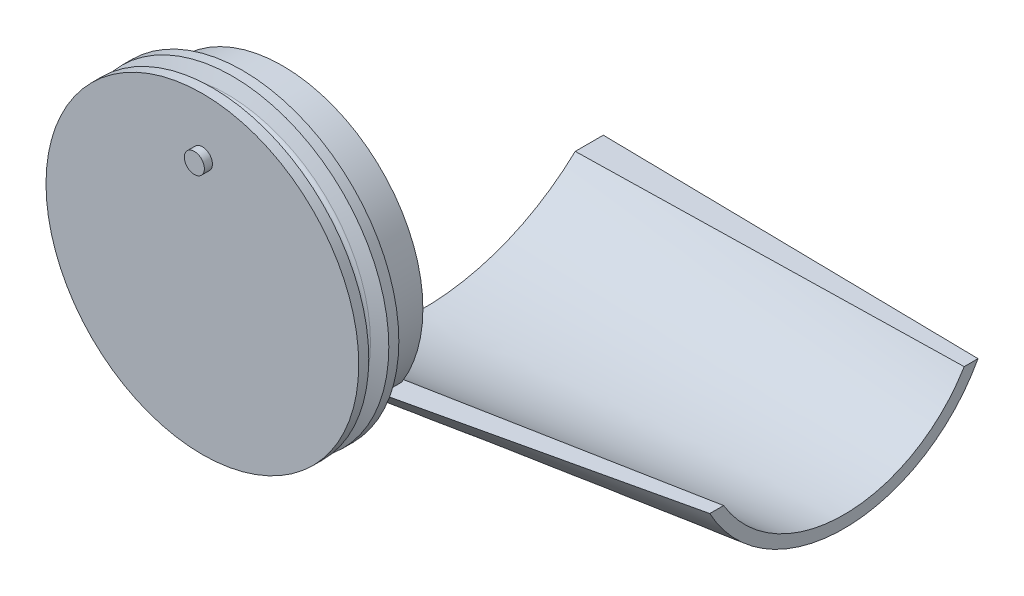
ISO-10303-21;
HEADER;
FILE_DESCRIPTION(('STEP AP214'),'2;1');
FILE_NAME('part.step','',(''),(''),'','','');
FILE_SCHEMA(('AUTOMOTIVE_DESIGN { 1 0 10303 214 1 1 1 1 }'));
ENDSEC;
DATA;
#1=APPLICATION_CONTEXT('core data for automotive mechanical design processes');
#2=APPLICATION_PROTOCOL_DEFINITION('international standard','automotive_design',2000,#1);
#3=PRODUCT_CONTEXT('',#1,'mechanical');
#4=PRODUCT('Part','Part','',(#3));
#5=PRODUCT_RELATED_PRODUCT_CATEGORY('part','',(#4));
#6=PRODUCT_DEFINITION_FORMATION('','',#4);
#7=PRODUCT_DEFINITION_CONTEXT('part definition',#1,'design');
#8=PRODUCT_DEFINITION('design','',#6,#7);
#9=PRODUCT_DEFINITION_SHAPE('','',#8);
#10=(LENGTH_UNIT() NAMED_UNIT(*) SI_UNIT(.MILLI.,.METRE.));
#11=(NAMED_UNIT(*) PLANE_ANGLE_UNIT() SI_UNIT($,.RADIAN.));
#12=(NAMED_UNIT(*) SI_UNIT($,.STERADIAN.) SOLID_ANGLE_UNIT());
#13=UNCERTAINTY_MEASURE_WITH_UNIT(LENGTH_MEASURE(1.E-05),#10,'distance_accuracy_value','');
#14=(GEOMETRIC_REPRESENTATION_CONTEXT(3) GLOBAL_UNCERTAINTY_ASSIGNED_CONTEXT((#13)) GLOBAL_UNIT_ASSIGNED_CONTEXT((#10,
#11,#12)) REPRESENTATION_CONTEXT('',''));
#15=CARTESIAN_POINT('',(0.,0.,0.));
#16=DIRECTION('',(0.,0.,1.));
#17=DIRECTION('',(1.,0.,0.));
#18=AXIS2_PLACEMENT_3D('',#15,#16,#17);
#19=CARTESIAN_POINT('',(0.,0.,0.));
#20=DIRECTION('',(0.,0.,1.));
#21=DIRECTION('',(1.,0.,0.));
#22=AXIS2_PLACEMENT_3D('',#19,#20,#21);
#23=PLANE('',#22);
#24=CARTESIAN_POINT('',(0.,0.,0.));
#25=DIRECTION('',(0.,0.,1.));
#26=DIRECTION('',(1.,0.,0.));
#27=AXIS2_PLACEMENT_3D('',#24,#25,#26);
#28=CIRCLE('',#27,15.);
#29=CARTESIAN_POINT('',(15.,0.,0.));
#30=VERTEX_POINT('',#29);
#31=EDGE_CURVE('E353',#30,#30,#28,.T.);
#32=ORIENTED_EDGE('',*,*,#31,.T.);
#33=EDGE_LOOP('',(#32));
#34=FACE_BOUND('',#33,.T.);
#35=DIRECTION('',(0.998752338877845,0.0499376169438923,0.));
#36=VECTOR('',#35,1.);
#37=CARTESIAN_POINT('',(0.997506234413968,-19.9501246882793,0.));
#38=LINE('',#37,#36);
#39=CARTESIAN_POINT('',(23.0574529661965,-18.8471273516902,0.));
#40=VERTEX_POINT('',#39);
#41=CARTESIAN_POINT('',(29.7018205805051,-18.5149089709748,0.));
#42=VERTEX_POINT('',#41);
#43=EDGE_CURVE('E234',#40,#42,#38,.T.);
#44=ORIENTED_EDGE('',*,*,#43,.F.);
#45=CARTESIAN_POINT('',(23.0574529661965,-18.8471273516902,0.));
#46=CARTESIAN_POINT('',(22.2916022190324,-18.9889397255002,0.));
#47=CARTESIAN_POINT('',(21.5253890123733,-19.128788030371,0.));
#48=CARTESIAN_POINT('',(19.9923482768048,-19.4047632030319,0.));
#49=CARTESIAN_POINT('',(19.2255207950077,-19.5408903324597,0.));
#50=CARTESIAN_POINT('',(17.6912902957024,-19.8096434498456,0.));
#51=CARTESIAN_POINT('',(16.9238873070428,-19.9422696026188,0.));
#52=CARTESIAN_POINT('',(15.3885392283414,-20.2042155018485,0.));
#53=CARTESIAN_POINT('',(14.6205941538221,-20.3335353393244,0.));
#54=CARTESIAN_POINT('',(13.0841928700881,-20.5890475414554,0.));
#55=CARTESIAN_POINT('',(12.315736666621,-20.7152399406868,0.));
#56=CARTESIAN_POINT('',(10.7783534139274,-20.9646585186056,0.));
#57=CARTESIAN_POINT('',(10.0094263709039,-21.0878847355429,0.));
#58=CARTESIAN_POINT('',(8.471111790358,-21.3315233812561,0.));
#59=CARTESIAN_POINT('',(7.70172424433659,-21.4519357563478,0.));
#60=CARTESIAN_POINT('',(6.16250972977857,-21.6900847019524,0.));
#61=CARTESIAN_POINT('',(5.39268274779645,-21.8078211855334,0.));
#62=CARTESIAN_POINT('',(3.85260895768149,-22.0407461475787,0.));
#63=CARTESIAN_POINT('',(3.08236213257115,-22.1559345137353,0.));
#64=CARTESIAN_POINT('',(1.54146614550797,-22.3838790995545,0.));
#65=CARTESIAN_POINT('',(0.770816964085725,-22.4966351876278,0.));
#66=CARTESIAN_POINT('',(0.,-22.6082295326803,0.));
#67=B_SPLINE_CURVE_WITH_KNOTS('',3,(#45,#46,#47,#48,#49,#50,#51,#52,#53,#54,#55,#56,#57,#58,#59,
#60,#61,#62,#63,#64,#65,#66),.UNSPECIFIED.,.F.,.F.,(4,2,2,2,2,2,2,2,2,2,4),(0.,2.33660498122198,
4.67304524981457,7.0093753291906,9.34564102239082,11.6818808746488,14.0180905841324,
16.3543448289866,18.6906748637148,21.0271076673683,23.3636665596837),.UNSPECIFIED.);
#68=CARTESIAN_POINT('',(0.,-22.608699195932,2.94938227622188E-08));
#69=VERTEX_POINT('',#68);
#70=EDGE_CURVE('E12',#40,#69,#67,.T.);
#71=ORIENTED_EDGE('',*,*,#70,.T.);
#72=DIRECTION('',(0.,1.,0.));
#73=VECTOR('',#72,1.);
#74=CARTESIAN_POINT('',(0.,0.,0.));
#75=LINE('',#74,#73);
#76=CARTESIAN_POINT('',(0.,-28.8762786833392,2.65474298902398E-09));
#77=VERTEX_POINT('',#76);
#78=EDGE_CURVE('E79',#77,#69,#75,.T.);
#79=ORIENTED_EDGE('',*,*,#78,.F.);
#80=CARTESIAN_POINT('',(0.,-28.8762293508559,-4.86217432960588E-09));
#81=CARTESIAN_POINT('',(0.987714442048364,-28.7331730352976,-1.74602065120115E-09));
#82=CARTESIAN_POINT('',(1.97521353454427,-28.5886256861832,-4.67826676747853E-10));
#83=CARTESIAN_POINT('',(3.94966770078597,-28.2963900436687,4.67790025991617E-10));
#84=CARTESIAN_POINT('',(4.93662281109079,-28.1487019972256,1.25339721859396E-10));
#85=CARTESIAN_POINT('',(6.90996284563093,-27.8500139563771,-1.25331132282855E-10));
#86=CARTESIAN_POINT('',(7.89634780430617,-27.6990141896344,-3.35814386069401E-11));
#87=CARTESIAN_POINT('',(9.86851758540095,-27.3935100024434,3.35795278206633E-11));
#88=CARTESIAN_POINT('',(10.8543024387747,-27.2390057818992,8.99741993983633E-12));
#89=CARTESIAN_POINT('',(12.8252414647675,-26.9262953480926,-8.99703171313495E-12));
#90=CARTESIAN_POINT('',(13.8103956627641,-26.768089294854,-2.41072037336909E-12));
#91=CARTESIAN_POINT('',(15.7800389522988,-26.4477528747474,2.41065554065078E-12));
#92=CARTESIAN_POINT('',(16.7645280610114,-26.2856226135324,6.45944704430521E-13));
#93=CARTESIAN_POINT('',(18.7328440677965,-25.9571863611272,-6.45966533334797E-13));
#94=CARTESIAN_POINT('',(19.7166709423662,-25.7908802290085,-1.7309131896018E-13));
#95=CARTESIAN_POINT('',(21.6835748466414,-25.4538294968453,1.73093081070269E-13));
#96=CARTESIAN_POINT('',(22.6666518686114,-25.2830848516335,0.));
#97=CARTESIAN_POINT('',(24.632002128606,-24.936859540798,0.));
#98=CARTESIAN_POINT('',(25.6142753419782,-24.7613787351424,0.));
#99=CARTESIAN_POINT('',(27.5779576561674,-24.4053491228362,0.));
#100=CARTESIAN_POINT('',(28.5593667079592,-24.2248000456346,0.));
#101=CARTESIAN_POINT('',(30.5212546323829,-23.8582666460942,0.));
#102=CARTESIAN_POINT('',(31.501733421159,-23.6722818744178,0.));
#103=CARTESIAN_POINT('',(33.4616817082158,-23.2944505211443,0.));
#104=CARTESIAN_POINT('',(34.4411510722366,-23.1026032433632,0.));
#105=CARTESIAN_POINT('',(35.42,-22.9076263811486,0.));
#106=B_SPLINE_CURVE_WITH_KNOTS('',3,(#80,#81,#82,#83,#84,#85,#86,#87,#88,#89,#90,#91,#92,#93,
#94,#95,#96,#97,#98,#99,#100,#101,#102,#103,#104,#105),.UNSPECIFIED.,.F.,.F.,(4,2,2,2,2,2,2,2,2,
2,2,2,4),(0.,2.9940612614052,5.98788796027924,8.98150949112513,11.9749606846902,
14.9682827148183,17.9615242440281,20.9548669261421,23.9482400811843,26.9417018370541,
29.9353236928895,32.9291937180938,35.9234206634662),.UNSPECIFIED.);
#107=CARTESIAN_POINT('',(24.5441383635427,-24.9516587022038,-1.08637057683048E-13));
#108=VERTEX_POINT('',#107);
#109=EDGE_CURVE('E230',#77,#108,#106,.T.);
#110=ORIENTED_EDGE('',*,*,#109,.T.);
#111=CARTESIAN_POINT('',(0.,0.,0.));
#112=DIRECTION('',(0.,0.,1.));
#113=DIRECTION('',(1.,0.,0.));
#114=AXIS2_PLACEMENT_3D('',#111,#112,#113);
#115=CIRCLE('',#114,35.);
#116=EDGE_CURVE('E356',#42,#108,#115,.T.);
#117=ORIENTED_EDGE('',*,*,#116,.F.);
#118=EDGE_LOOP('',(#44,#71,#79,#110,#117));
#119=FACE_BOUND('',#118,.T.);
#120=ADVANCED_FACE('F69',(#34,#119),#23,.F.);
#121=CARTESIAN_POINT('',(0.,0.,10.));
#122=DIRECTION('',(0.,0.,-1.));
#123=DIRECTION('',(-1.,0.,0.));
#124=AXIS2_PLACEMENT_3D('',#121,#122,#123);
#125=CYLINDRICAL_SURFACE('',#124,35.);
#126=CARTESIAN_POINT('',(0.,0.,10.));
#127=DIRECTION('',(0.,0.,-1.));
#128=DIRECTION('',(-1.,0.,0.));
#129=AXIS2_PLACEMENT_3D('',#126,#127,#128);
#130=CIRCLE('',#129,35.);
#131=CARTESIAN_POINT('',(-35.,0.,10.));
#132=VERTEX_POINT('',#131);
#133=EDGE_CURVE('E74',#132,#132,#130,.T.);
#134=ORIENTED_EDGE('',*,*,#133,.T.);
#135=EDGE_LOOP('',(#134));
#136=FACE_BOUND('',#135,.T.);
#137=DIRECTION('',(0.,0.,-1.));
#138=VECTOR('',#137,1.);
#139=CARTESIAN_POINT('',(29.7018205805051,-18.5149089709748,10.));
#140=LINE('',#139,#138);
#141=CARTESIAN_POINT('',(29.7018205805052,-18.5149089709747,5.08399807933282));
#142=VERTEX_POINT('',#141);
#143=EDGE_CURVE('E366',#42,#142,#140,.F.);
#144=ORIENTED_EDGE('',*,*,#143,.F.);
#145=ORIENTED_EDGE('',*,*,#116,.T.);
#146=CARTESIAN_POINT('',(24.5441383635427,-24.9516587022038,-1.08637057683048E-13));
#147=CARTESIAN_POINT('',(24.7060750011053,-24.7923660678679,0.146607515695075));
#148=CARTESIAN_POINT('',(24.8665664645577,-24.6313947345373,0.292988411582725));
#149=CARTESIAN_POINT('',(25.1843954115073,-24.3063331996264,0.584983989986377));
#150=CARTESIAN_POINT('',(25.3417371394652,-24.1422478703518,0.730599476840608));
#151=CARTESIAN_POINT('',(25.6532898198079,-23.8109295582881,1.02100643589274));
#152=CARTESIAN_POINT('',(25.807504248791,-23.6437005199525,1.16579867791068));
#153=CARTESIAN_POINT('',(26.1128168298606,-23.3060626224813,1.45450592789683));
#154=CARTESIAN_POINT('',(26.2639176688596,-23.1356567694429,1.59842160965226));
#155=CARTESIAN_POINT('',(26.5630111063875,-22.791629196476,1.88532508383329));
#156=CARTESIAN_POINT('',(26.711005567648,-22.6180095285052,2.02831339461363));
#157=CARTESIAN_POINT('',(27.0038871181968,-22.2675149059233,2.31331513985529));
#158=CARTESIAN_POINT('',(27.1487752018541,-22.0906410277365,2.45532887607902));
#159=CARTESIAN_POINT('',(27.4354554951758,-21.7335732745787,2.73835205824704));
#160=CARTESIAN_POINT('',(27.5772474141628,-21.5533790907906,2.8793614090663));
#161=CARTESIAN_POINT('',(27.8577046520914,-21.1896447776271,3.1603134296863));
#162=CARTESIAN_POINT('',(27.9963690904983,-21.0061037316186,3.30025579191565));
#163=CARTESIAN_POINT('',(28.2705504229162,-20.6356273621868,3.57902822460617));
#164=CARTESIAN_POINT('',(28.4060654418792,-20.4486901291089,3.71785760177288));
#165=CARTESIAN_POINT('',(28.6739205267323,-20.0713691238742,3.99435931850973));
#166=CARTESIAN_POINT('',(28.8062576434072,-19.8809824176428,4.13203051170326));
#167=CARTESIAN_POINT('',(29.0677233469871,-19.4967057370268,4.40617159724121));
#168=CARTESIAN_POINT('',(29.1968478182727,-19.3028117683763,4.5426398172419));
#169=CARTESIAN_POINT('',(29.4518472687978,-18.9114599727219,4.81433086882287));
#170=CARTESIAN_POINT('',(29.577716858043,-18.7139970526543,4.94955142249118));
#171=CARTESIAN_POINT('',(29.7018205805052,-18.5149089709747,5.08399807933282));
#172=B_SPLINE_CURVE_WITH_KNOTS('',3,(#146,#147,#148,#149,#150,#151,#152,#153,#154,#155,#156,
#157,#158,#159,#160,#161,#162,#163,#164,#165,#166,#167,#168,#169,#170,#171),.UNSPECIFIED.,.F.,
.F.,(4,2,2,2,2,2,2,2,2,2,2,2,4),(0.,0.811054198791024,1.62092976718313,2.42984928150636,
3.23803872275271,4.04572882793854,4.85315640567353,5.66065946406986,6.46838710443916,
7.27658391664393,8.08550384773345,8.89541163291683,9.70658432647791),.UNSPECIFIED.);
#173=EDGE_CURVE('E359',#108,#142,#172,.T.);
#174=ORIENTED_EDGE('',*,*,#173,.T.);
#175=EDGE_LOOP('',(#144,#145,#174));
#176=FACE_BOUND('',#175,.T.);
#177=ADVANCED_FACE('F71',(#136,#176),#125,.T.);
#178=CARTESIAN_POINT('',(0.,0.,10.));
#179=DIRECTION('',(0.,0.,-1.));
#180=DIRECTION('',(-1.,0.,0.));
#181=AXIS2_PLACEMENT_3D('',#178,#179,#180);
#182=CYLINDRICAL_SURFACE('',#181,15.);
#183=CARTESIAN_POINT('',(0.,0.,10.));
#184=DIRECTION('',(0.,0.,1.));
#185=DIRECTION('',(1.,0.,0.));
#186=AXIS2_PLACEMENT_3D('',#183,#184,#185);
#187=CIRCLE('',#186,15.);
#188=CARTESIAN_POINT('',(15.,0.,10.));
#189=VERTEX_POINT('',#188);
#190=EDGE_CURVE('E208',#189,#189,#187,.T.);
#191=ORIENTED_EDGE('',*,*,#190,.T.);
#192=EDGE_LOOP('',(#191));
#193=FACE_BOUND('',#192,.T.);
#194=ORIENTED_EDGE('',*,*,#31,.F.);
#195=EDGE_LOOP('',(#194));
#196=FACE_BOUND('',#195,.T.);
#197=ADVANCED_FACE('F219',(#193,#196),#182,.F.);
#198=CARTESIAN_POINT('',(0.,20.625,-35.));
#199=DIRECTION('',(1.,0.,0.));
#200=DIRECTION('',(0.,0.,-1.));
#201=AXIS2_PLACEMENT_3D('',#198,#199,#200);
#202=PLANE('',#201);
#203=CARTESIAN_POINT('',(0.,20.625,-35.));
#204=DIRECTION('',(1.,0.,0.));
#205=DIRECTION('',(0.,0.,-1.));
#206=AXIS2_PLACEMENT_3D('',#203,#204,#205);
#207=CIRCLE('',#206,60.625);
#208=CARTESIAN_POINT('',(0.,-20.,-80.));
#209=VERTEX_POINT('',#208);
#210=EDGE_CURVE('E143',#77,#209,#207,.T.);
#211=ORIENTED_EDGE('',*,*,#210,.F.);
#212=ORIENTED_EDGE('',*,*,#78,.T.);
#213=CARTESIAN_POINT('',(0.,20.625,-35.));
#214=DIRECTION('',(-1.,0.,0.));
#215=DIRECTION('',(0.,0.,-1.));
#216=AXIS2_PLACEMENT_3D('',#213,#214,#215);
#217=CIRCLE('',#216,55.625);
#218=CARTESIAN_POINT('',(0.,-20.,-72.9967103839266));
#219=VERTEX_POINT('',#218);
#220=EDGE_CURVE('E123',#219,#69,#217,.T.);
#221=ORIENTED_EDGE('',*,*,#220,.F.);
#222=DIRECTION('',(0.,0.,1.));
#223=VECTOR('',#222,1.);
#224=CARTESIAN_POINT('',(0.,-20.,-72.9967103839266));
#225=LINE('',#224,#223);
#226=EDGE_CURVE('E127',#209,#219,#225,.T.);
#227=ORIENTED_EDGE('',*,*,#226,.F.);
#228=EDGE_LOOP('',(#211,#212,#221,#227));
#229=FACE_BOUND('',#228,.T.);
#230=ADVANCED_FACE('F126',(#229),#202,.F.);
#231=CARTESIAN_POINT('',(0.,-20.,-72.9967103839266));
#232=CARTESIAN_POINT('',(100.,-15.,-70.));
#233=CARTESIAN_POINT('',(0.,-21.0814606741573,-71.8404434480861));
#234=CARTESIAN_POINT('',(100.,-16.0723296888142,-69.357653490328));
#235=CARTESIAN_POINT('',(0.,-22.1318700080847,-70.617873122367));
#236=CARTESIAN_POINT('',(100.,-17.1430415908006,-68.638102526912));
#237=CARTESIAN_POINT('',(0.,-24.1499445273215,-68.045244991354));
#238=CARTESIAN_POINT('',(100.,-19.2531903457666,-67.0333624749692));
#239=CARTESIAN_POINT('',(0.,-25.1176097126309,-66.69518718606));
#240=CARTESIAN_POINT('',(100.,-20.2925949705135,-66.1480941129829));
#241=CARTESIAN_POINT('',(0.,-26.9495544664736,-63.8727033960797));
#242=CARTESIAN_POINT('',(100.,-22.306663896612,-64.2065909055454));
#243=CARTESIAN_POINT('',(0.,-27.8135710534606,-62.4002385648158));
#244=CARTESIAN_POINT('',(100.,-23.2812607261325,-63.1502816402224));
#245=CARTESIAN_POINT('',(0.,-29.4182371795988,-59.3463258960442));
#246=CARTESIAN_POINT('',(100.,-25.1283034852057,-60.8697723512932));
#247=CARTESIAN_POINT('',(0.,-30.15888671875,-57.7648780585367));
#248=CARTESIAN_POINT('',(100.,-26.0006459132942,-59.6455202848445));
#249=CARTESIAN_POINT('',(0.,-31.49736328125,-54.5064622435817));
#250=CARTESIAN_POINT('',(100.,-27.6043939427099,-57.0425743410233));
#251=CARTESIAN_POINT('',(0.,-32.0949110523519,-52.8296151658013));
#252=CARTESIAN_POINT('',(100.,-28.3356691074337,-55.6638698839974));
#253=CARTESIAN_POINT('',(0.,-33.1325206514784,-49.4018686713336));
#254=CARTESIAN_POINT('',(100.,-29.620677132662,-52.7768536920229));
#255=CARTESIAN_POINT('',(0.,-33.5725824795029,-47.6509692546464));
#256=CARTESIAN_POINT('',(100.,-30.174272866667,-51.2685871515839));
#257=CARTESIAN_POINT('',(0.,-34.2811152696933,-44.096344084064));
#258=CARTESIAN_POINT('',(100.,-31.0735996910293,-48.1581947940897));
#259=CARTESIAN_POINT('',(0.,-34.5494030510437,-42.2928939925286));
#260=CARTESIAN_POINT('',(100.,-31.4192150451166,-46.5561723712403));
#261=CARTESIAN_POINT('',(0.,-34.9088454161971,-38.6596860263));
#262=CARTESIAN_POINT('',(100.,-31.8824484833603,-43.3026954620268));
#263=CARTESIAN_POINT('',(0.,-35.,-36.8299281516068));
#264=CARTESIAN_POINT('',(100.,-32.,-41.6513888888889));
#265=CARTESIAN_POINT('',(0.,-35.,-33.1700718483931));
#266=CARTESIAN_POINT('',(100.,-32.,-38.3486111111111));
#267=CARTESIAN_POINT('',(0.,-34.9088454161971,-31.3403139736999));
#268=CARTESIAN_POINT('',(100.,-31.8824484833603,-36.6973045379732));
#269=CARTESIAN_POINT('',(0.,-34.5494030510437,-27.7071060074713));
#270=CARTESIAN_POINT('',(100.,-31.4192150451166,-33.4438276287597));
#271=CARTESIAN_POINT('',(0.,-34.2811152696932,-25.9036559159359));
#272=CARTESIAN_POINT('',(100.,-31.0735996910293,-31.8418052059103));
#273=CARTESIAN_POINT('',(0.,-33.5725824795029,-22.3490307453536));
#274=CARTESIAN_POINT('',(100.,-30.174272866667,-28.731412848416));
#275=CARTESIAN_POINT('',(0.,-33.1325206514784,-20.5981313286663));
#276=CARTESIAN_POINT('',(100.,-29.620677132662,-27.2231463079771));
#277=CARTESIAN_POINT('',(0.,-32.0949110523519,-17.1703848341987));
#278=CARTESIAN_POINT('',(100.,-28.3356691074336,-24.3361301160025));
#279=CARTESIAN_POINT('',(0.,-31.49736328125,-15.4935377564183));
#280=CARTESIAN_POINT('',(100.,-27.6043939427099,-22.9574256589767));
#281=CARTESIAN_POINT('',(0.,-30.15888671875,-12.2351219414633));
#282=CARTESIAN_POINT('',(100.,-26.0006459132942,-20.3544797151555));
#283=CARTESIAN_POINT('',(0.,-29.4182371795987,-10.6536741039557));
#284=CARTESIAN_POINT('',(100.,-25.1283034852057,-19.1302276487068));
#285=CARTESIAN_POINT('',(0.,-27.8135710534605,-7.59976143518417));
#286=CARTESIAN_POINT('',(100.,-23.2812607261325,-16.8497183597775));
#287=CARTESIAN_POINT('',(0.,-26.9495544664736,-6.12729660392024));
#288=CARTESIAN_POINT('',(100.,-22.3066638966119,-15.7934090944546));
#289=CARTESIAN_POINT('',(0.,-25.1176097126309,-3.30481281393993));
#290=CARTESIAN_POINT('',(100.,-20.2925949705135,-13.8519058870171));
#291=CARTESIAN_POINT('',(0.,-24.1499445273215,-1.95475500864598));
#292=CARTESIAN_POINT('',(100.,-19.2531903457666,-12.9666375250307));
#293=CARTESIAN_POINT('',(0.,-22.1318700080847,0.617873122367089));
#294=CARTESIAN_POINT('',(100.,-17.1430415908006,-11.361897473088));
#295=CARTESIAN_POINT('',(0.,-21.0814606741573,1.8404434480862));
#296=CARTESIAN_POINT('',(100.,-16.0723296888141,-10.642346509672));
#297=CARTESIAN_POINT('',(0.,-20.,2.99671038392666));
#298=CARTESIAN_POINT('',(100.,-15.,-9.99999999999999));
#299=B_SPLINE_SURFACE_WITH_KNOTS('',3,1,((#231,#232),(#233,#234),(#235,#236),(#237,#238),(#239,
#240),(#241,#242),(#243,#244),(#245,#246),(#247,#248),(#249,#250),(#251,#252),(#253,#254),(#255,
#256),(#257,#258),(#259,#260),(#261,#262),(#263,#264),(#265,#266),(#267,#268),(#269,#270),(#271,
#272),(#273,#274),(#275,#276),(#277,#278),(#279,#280),(#281,#282),(#283,#284),(#285,#286),(#287,
#288),(#289,#290),(#291,#292),(#293,#294),(#295,#296),(#297,#298)),.UNSPECIFIED.,.F.,.F.,.F.,(4,
2,2,2,2,2,2,2,2,2,2,2,2,2,2,2,4),(2,2),(0.,0.0625000000000002,0.125,0.187500000000001,0.25,
0.3125,0.375,0.4375,0.5,0.5625,0.625,0.6875,0.75,0.8125,0.875,0.9375,1.),(0.,1.),.UNSPECIFIED.);
#300=DIRECTION('',(0.990443045890749,0.0495221522945374,-0.128725014192162));
#301=VECTOR('',#300,1.);
#302=CARTESIAN_POINT('',(0.,-20.,2.99671038392666));
#303=LINE('',#302,#301);
#304=CARTESIAN_POINT('',(100.,-15.,-9.99999999999999));
#305=VERTEX_POINT('',#304);
#306=EDGE_CURVE('E155',#40,#305,#303,.T.);
#307=CARTESIAN_POINT('',(100.,2.97058823529413,-40.));
#308=DIRECTION('',(-1.,0.,0.));
#309=DIRECTION('',(0.,0.,-1.));
#310=AXIS2_PLACEMENT_3D('',#307,#308,#309);
#311=CIRCLE('',#310,34.9705882352941);
#312=CARTESIAN_POINT('',(100.,-15.,-70.));
#313=VERTEX_POINT('',#312);
#314=EDGE_CURVE('E150',#313,#305,#311,.T.);
#315=DIRECTION('',(0.998305304090061,0.0499152652045028,0.0299163187109573));
#316=VECTOR('',#315,1.);
#317=CARTESIAN_POINT('',(0.,-20.,-72.9967103839266));
#318=LINE('',#317,#316);
#319=EDGE_CURVE('E140',#219,#313,#318,.T.);
#320=ORIENTED_EDGE('',*,*,#70,.F.);
#321=ORIENTED_EDGE('',*,*,#306,.T.);
#322=ORIENTED_EDGE('',*,*,#314,.F.);
#323=ORIENTED_EDGE('',*,*,#319,.F.);
#324=ORIENTED_EDGE('',*,*,#220,.T.);
#325=EDGE_LOOP('',(#320,#321,#322,#323,#324));
#326=FACE_BOUND('',#325,.T.);
#327=ADVANCED_FACE('F148',(#326),#299,.T.);
#328=CARTESIAN_POINT('',(0.997506234413968,-19.9501246882793,0.));
#329=DIRECTION('',(0.0499376169438923,-0.998752338877845,0.));
#330=DIRECTION('',(0.998752338877845,0.0499376169438923,0.));
#331=AXIS2_PLACEMENT_3D('',#328,#329,#330);
#332=PLANE('',#331);
#333=ORIENTED_EDGE('',*,*,#306,.F.);
#334=ORIENTED_EDGE('',*,*,#43,.T.);
#335=ORIENTED_EDGE('',*,*,#143,.T.);
#336=DIRECTION('',(0.985379908178143,0.0492689954089072,-0.163092006702447));
#337=VECTOR('',#336,1.);
#338=CARTESIAN_POINT('',(0.,-20.,10.));
#339=LINE('',#338,#337);
#340=CARTESIAN_POINT('',(100.,-15.,-6.55118044815683));
#341=VERTEX_POINT('',#340);
#342=EDGE_CURVE('E87',#142,#341,#339,.T.);
#343=ORIENTED_EDGE('',*,*,#342,.T.);
#344=DIRECTION('',(0.,0.,1.));
#345=VECTOR('',#344,1.);
#346=CARTESIAN_POINT('',(100.,-15.,-9.99999999999999));
#347=LINE('',#346,#345);
#348=EDGE_CURVE('E378',#305,#341,#347,.T.);
#349=ORIENTED_EDGE('',*,*,#348,.F.);
#350=EDGE_LOOP('',(#333,#334,#335,#343,#349));
#351=FACE_BOUND('',#350,.T.);
#352=ADVANCED_FACE('F180',(#351),#332,.F.);
#353=CARTESIAN_POINT('',(0.,-20.,10.));
#354=CARTESIAN_POINT('',(100.,-15.,-6.55118044815682));
#355=CARTESIAN_POINT('',(0.,-21.3917525773196,8.74355670103094));
#356=CARTESIAN_POINT('',(100.,-16.2277304415182,-7.21078633332904));
#357=CARTESIAN_POINT('',(0.,-22.7542525773196,7.39564003436427));
#358=CARTESIAN_POINT('',(100.,-17.4598940665429,-7.95991045314037));
#359=CARTESIAN_POINT('',(0.,-25.3896262886598,4.51969501718214));
#360=CARTESIAN_POINT('',(100.,-19.900407259498,-9.65383862275729));
#361=CARTESIAN_POINT('',(0.,-26.6625,2.99166666666668));
#362=CARTESIAN_POINT('',(100.,-21.108727964456,-10.5987526615265));
#363=CARTESIAN_POINT('',(0.,-29.0875,-0.241666666666657));
#364=CARTESIAN_POINT('',(100.,-23.461199809674,-12.6941875335759));
#365=CARTESIAN_POINT('',(0.,-30.2391652249135,-1.94713811995386));
#366=CARTESIAN_POINT('',(100.,-24.6052723418525,-13.8448186743244));
#367=CARTESIAN_POINT('',(0.,-32.3893598615917,-5.5189085928489));
#368=CARTESIAN_POINT('',(100.,-26.7827675635739,-16.3513337489159));
#369=CARTESIAN_POINT('',(0.,-33.3878892733564,-7.38520761245673));
#370=CARTESIAN_POINT('',(100.,-27.8160568007334,-17.7073029598029));
#371=CARTESIAN_POINT('',(0.,-35.2003460207613,-11.2618512110726));
#372=CARTESIAN_POINT('',(100.,-29.7225532378766,-20.6108186218288));
#373=CARTESIAN_POINT('',(0.,-36.0144265887509,-13.2712442171901));
#374=CARTESIAN_POINT('',(100.,-30.5955818310478,-22.1583951138944));
#375=CARTESIAN_POINT('',(0.,-37.431519357195,-17.4044314584855));
#376=CARTESIAN_POINT('',(100.,-32.1339094398364,-25.4162802820661));
#377=CARTESIAN_POINT('',(0.,-38.0344660916122,-19.5281826293873));
#378=CARTESIAN_POINT('',(100.,-32.7990129275886,-27.1265386426406));
#379=CARTESIAN_POINT('',(0.,-39.0082168352171,-23.8559637120761));
#380=CARTESIAN_POINT('',(100.,-33.8813676329668,-30.6659910352048));
#381=CARTESIAN_POINT('',(0.,-39.3789704142012,-26.0599289940828));
#382=CARTESIAN_POINT('',(100.,-34.2984492851187,-32.495046912417));
#383=CARTESIAN_POINT('',(0.,-39.874875739645,-30.5093017751479));
#384=CARTESIAN_POINT('',(100.,-34.8578150113326,-36.2161677686027));
#385=CARTESIAN_POINT('',(0.,-40.,-32.7546296296296));
#386=CARTESIAN_POINT('',(100.,-35.,-38.1080254976591));
#387=CARTESIAN_POINT('',(0.,-40.,-37.2453703703704));
#388=CARTESIAN_POINT('',(100.,-35.,-41.8919745023409));
#389=CARTESIAN_POINT('',(0.,-39.874875739645,-39.490698224852));
#390=CARTESIAN_POINT('',(100.,-34.8578150113326,-43.7838322313973));
#391=CARTESIAN_POINT('',(0.,-39.3789704142012,-43.9400710059171));
#392=CARTESIAN_POINT('',(100.,-34.2984492851187,-47.504953087583));
#393=CARTESIAN_POINT('',(0.,-39.0082168352171,-46.1440362879238));
#394=CARTESIAN_POINT('',(100.,-33.8813676329668,-49.3340089647952));
#395=CARTESIAN_POINT('',(0.,-38.0344660916121,-50.4718173706127));
#396=CARTESIAN_POINT('',(100.,-32.7990129275886,-52.8734613573594));
#397=CARTESIAN_POINT('',(0.,-37.4315193571951,-52.5955685415145));
#398=CARTESIAN_POINT('',(100.,-32.1339094398364,-54.5837197179338));
#399=CARTESIAN_POINT('',(0.,-36.0144265887509,-56.7287557828098));
#400=CARTESIAN_POINT('',(100.,-30.5955818310478,-57.8416048861056));
#401=CARTESIAN_POINT('',(0.,-35.2003460207613,-58.7381487889273));
#402=CARTESIAN_POINT('',(100.,-29.7225532378766,-59.3891813781711));
#403=CARTESIAN_POINT('',(0.,-33.3878892733564,-62.6147923875432));
#404=CARTESIAN_POINT('',(100.,-27.8160568007334,-62.2926970401971));
#405=CARTESIAN_POINT('',(0.,-32.3893598615917,-64.4810914071511));
#406=CARTESIAN_POINT('',(100.,-26.7827675635739,-63.6486662510841));
#407=CARTESIAN_POINT('',(0.,-30.2391652249135,-68.0528618800461));
#408=CARTESIAN_POINT('',(100.,-24.6052723418525,-66.1551813256756));
#409=CARTESIAN_POINT('',(0.,-29.0875,-69.7583333333333));
#410=CARTESIAN_POINT('',(100.,-23.461199809674,-67.3058124664241));
#411=CARTESIAN_POINT('',(0.,-26.6625,-72.9916666666667));
#412=CARTESIAN_POINT('',(100.,-21.108727964456,-69.4012473384735));
#413=CARTESIAN_POINT('',(0.,-25.3896262886598,-74.5196950171821));
#414=CARTESIAN_POINT('',(100.,-19.900407259498,-70.3461613772427));
#415=CARTESIAN_POINT('',(0.,-22.7542525773196,-77.3956400343642));
#416=CARTESIAN_POINT('',(100.,-17.4598940665429,-72.0400895468596));
#417=CARTESIAN_POINT('',(0.,-21.3917525773196,-78.7435567010309));
#418=CARTESIAN_POINT('',(100.,-16.2277304415182,-72.7892136666709));
#419=CARTESIAN_POINT('',(0.,-20.,-79.9999999999999));
#420=CARTESIAN_POINT('',(100.,-15.,-73.4488195518432));
#421=B_SPLINE_SURFACE_WITH_KNOTS('',3,1,((#353,#354),(#355,#356),(#357,#358),(#359,#360),(#361,
#362),(#363,#364),(#365,#366),(#367,#368),(#369,#370),(#371,#372),(#373,#374),(#375,#376),(#377,
#378),(#379,#380),(#381,#382),(#383,#384),(#385,#386),(#387,#388),(#389,#390),(#391,#392),(#393,
#394),(#395,#396),(#397,#398),(#399,#400),(#401,#402),(#403,#404),(#405,#406),(#407,#408),(#409,
#410),(#411,#412),(#413,#414),(#415,#416),(#417,#418),(#419,#420)),.UNSPECIFIED.,.F.,.F.,.F.,(4,
2,2,2,2,2,2,2,2,2,2,2,2,2,2,2,4),(2,2),(0.,0.0624999999999999,0.125,0.1875,0.249999999999999,
0.312499999999999,0.374999999999999,0.437499999999999,0.499999999999999,0.562499999999999,
0.624999999999999,0.687499999999999,0.749999999999999,0.8125,0.875,0.9375,1.),(0.,1.),.UNSPECIFIED.);
#422=DIRECTION('',(0.996621302597794,0.0498310651298902,0.0652904599179521));
#423=VECTOR('',#422,1.);
#424=CARTESIAN_POINT('',(50.,-17.5,-76.7244097759216));
#425=LINE('',#424,#423);
#426=CARTESIAN_POINT('',(100.,-15.,-73.4488195518432));
#427=VERTEX_POINT('',#426);
#428=EDGE_CURVE('E142',#209,#427,#425,.T.);
#429=CARTESIAN_POINT('',(100.,2.97058823529413,-40.));
#430=DIRECTION('',(1.,0.,0.));
#431=DIRECTION('',(0.,0.,-1.));
#432=AXIS2_PLACEMENT_3D('',#429,#430,#431);
#433=CIRCLE('',#432,37.9705882352941);
#434=EDGE_CURVE('E379',#341,#427,#433,.T.);
#435=ORIENTED_EDGE('',*,*,#109,.F.);
#436=ORIENTED_EDGE('',*,*,#210,.T.);
#437=ORIENTED_EDGE('',*,*,#428,.T.);
#438=ORIENTED_EDGE('',*,*,#434,.F.);
#439=ORIENTED_EDGE('',*,*,#342,.F.);
#440=ORIENTED_EDGE('',*,*,#173,.F.);
#441=EDGE_LOOP('',(#435,#436,#437,#438,#439,#440));
#442=FACE_BOUND('',#441,.T.);
#443=ADVANCED_FACE('F183',(#442),#421,.T.);
#444=CARTESIAN_POINT('',(100.,2.97058823529413,-40.));
#445=DIRECTION('',(1.,0.,0.));
#446=DIRECTION('',(0.,0.,-1.));
#447=AXIS2_PLACEMENT_3D('',#444,#445,#446);
#448=PLANE('',#447);
#449=ORIENTED_EDGE('',*,*,#314,.T.);
#450=ORIENTED_EDGE('',*,*,#348,.T.);
#451=ORIENTED_EDGE('',*,*,#434,.T.);
#452=DIRECTION('',(0.,0.,1.));
#453=VECTOR('',#452,1.);
#454=CARTESIAN_POINT('',(100.,-15.,-70.));
#455=LINE('',#454,#453);
#456=EDGE_CURVE('E153',#427,#313,#455,.T.);
#457=ORIENTED_EDGE('',*,*,#456,.T.);
#458=EDGE_LOOP('',(#449,#450,#451,#457));
#459=FACE_BOUND('',#458,.T.);
#460=ADVANCED_FACE('F393',(#459),#448,.T.);
#461=CARTESIAN_POINT('',(0.997506234413985,-19.9501246882797,-1.10381955442176E-13));
#462=DIRECTION('',(0.0499376169438922,-0.998752338877845,0.));
#463=DIRECTION('',(0.998752338877845,0.0499376169438922,0.));
#464=AXIS2_PLACEMENT_3D('',#461,#462,#463);
#465=PLANE('',#464);
#466=ORIENTED_EDGE('',*,*,#319,.T.);
#467=ORIENTED_EDGE('',*,*,#456,.F.);
#468=ORIENTED_EDGE('',*,*,#428,.F.);
#469=ORIENTED_EDGE('',*,*,#226,.T.);
#470=EDGE_LOOP('',(#466,#467,#468,#469));
#471=FACE_BOUND('',#470,.T.);
#472=ADVANCED_FACE('F138',(#471),#465,.F.);
#473=CARTESIAN_POINT('',(0.,0.,10.));
#474=DIRECTION('',(0.,0.,1.));
#475=DIRECTION('',(1.,0.,0.));
#476=AXIS2_PLACEMENT_3D('',#473,#474,#475);
#477=PLANE('',#476);
#478=ORIENTED_EDGE('',*,*,#190,.F.);
#479=EDGE_LOOP('',(#478));
#480=FACE_BOUND('',#479,.T.);
#481=ADVANCED_FACE('F263',(#480),#477,.F.);
#482=CARTESIAN_POINT('',(0.,0.,15.));
#483=DIRECTION('',(0.,0.,1.));
#484=DIRECTION('',(1.,0.,0.));
#485=AXIS2_PLACEMENT_3D('',#482,#483,#484);
#486=TOROIDAL_SURFACE('',#485,36.25,1.25);
#487=CARTESIAN_POINT('',(0.,0.,16.1538461538462));
#488=DIRECTION('',(0.,0.,1.));
#489=DIRECTION('',(1.,0.,0.));
#490=AXIS2_PLACEMENT_3D('',#487,#488,#489);
#491=CIRCLE('',#490,35.7692307692308);
#492=CARTESIAN_POINT('',(35.7692307692308,0.,16.1538461538462));
#493=VERTEX_POINT('',#492);
#494=EDGE_CURVE('E338',#493,#493,#491,.T.);
#495=ORIENTED_EDGE('',*,*,#494,.F.);
#496=EDGE_LOOP('',(#495));
#497=FACE_BOUND('',#496,.T.);
#498=CARTESIAN_POINT('',(0.,0.,13.8461538461538));
#499=DIRECTION('',(0.,0.,1.));
#500=DIRECTION('',(1.,0.,0.));
#501=AXIS2_PLACEMENT_3D('',#498,#499,#500);
#502=CIRCLE('',#501,35.7692307692308);
#503=CARTESIAN_POINT('',(35.7692307692308,0.,13.8461538461538));
#504=VERTEX_POINT('',#503);
#505=EDGE_CURVE('E335',#504,#504,#502,.T.);
#506=ORIENTED_EDGE('',*,*,#505,.T.);
#507=EDGE_LOOP('',(#506));
#508=FACE_BOUND('',#507,.T.);
#509=ADVANCED_FACE('F283',(#497,#508),#486,.F.);
#510=CARTESIAN_POINT('',(0.,0.,20.));
#511=DIRECTION('',(0.,0.,1.));
#512=DIRECTION('',(1.,0.,0.));
#513=AXIS2_PLACEMENT_3D('',#510,#511,#512);
#514=CYLINDRICAL_SURFACE('',#513,39.);
#515=CARTESIAN_POINT('',(0.,0.,17.5));
#516=DIRECTION('',(0.,0.,1.));
#517=DIRECTION('',(1.,0.,0.));
#518=AXIS2_PLACEMENT_3D('',#515,#516,#517);
#519=CIRCLE('',#518,39.);
#520=CARTESIAN_POINT('',(39.,0.,17.5));
#521=VERTEX_POINT('',#520);
#522=EDGE_CURVE('E340',#521,#521,#519,.T.);
#523=ORIENTED_EDGE('',*,*,#522,.T.);
#524=EDGE_LOOP('',(#523));
#525=FACE_BOUND('',#524,.T.);
#526=CARTESIAN_POINT('',(0.,0.,20.));
#527=DIRECTION('',(0.,0.,1.));
#528=DIRECTION('',(1.,0.,0.));
#529=AXIS2_PLACEMENT_3D('',#526,#527,#528);
#530=CIRCLE('',#529,39.);
#531=CARTESIAN_POINT('',(39.,0.,20.));
#532=VERTEX_POINT('',#531);
#533=EDGE_CURVE('E239',#532,#532,#530,.T.);
#534=ORIENTED_EDGE('',*,*,#533,.F.);
#535=EDGE_LOOP('',(#534));
#536=FACE_BOUND('',#535,.T.);
#537=ADVANCED_FACE('F291',(#525,#536),#514,.T.);
#538=CARTESIAN_POINT('',(0.,0.,17.5));
#539=DIRECTION('',(0.,0.,1.));
#540=DIRECTION('',(1.,0.,0.));
#541=AXIS2_PLACEMENT_3D('',#538,#539,#540);
#542=CONICAL_SURFACE('',#541,39.,1.17600520709513);
#543=ORIENTED_EDGE('',*,*,#494,.T.);
#544=EDGE_LOOP('',(#543));
#545=FACE_BOUND('',#544,.T.);
#546=ORIENTED_EDGE('',*,*,#522,.F.);
#547=EDGE_LOOP('',(#546));
#548=FACE_BOUND('',#547,.T.);
#549=ADVANCED_FACE('F294',(#545,#548),#542,.T.);
#550=CARTESIAN_POINT('',(0.,0.,13.8461538461538));
#551=DIRECTION('',(0.,0.,-1.));
#552=DIRECTION('',(-1.,0.,0.));
#553=AXIS2_PLACEMENT_3D('',#550,#551,#552);
#554=CONICAL_SURFACE('',#553,35.7692307692308,1.17600520709513);
#555=CARTESIAN_POINT('',(0.,0.,12.5));
#556=DIRECTION('',(0.,0.,1.));
#557=DIRECTION('',(1.,0.,0.));
#558=AXIS2_PLACEMENT_3D('',#555,#556,#557);
#559=CIRCLE('',#558,39.);
#560=CARTESIAN_POINT('',(39.,0.,12.5));
#561=VERTEX_POINT('',#560);
#562=EDGE_CURVE('E328',#561,#561,#559,.T.);
#563=ORIENTED_EDGE('',*,*,#562,.T.);
#564=EDGE_LOOP('',(#563));
#565=FACE_BOUND('',#564,.T.);
#566=ORIENTED_EDGE('',*,*,#505,.F.);
#567=EDGE_LOOP('',(#566));
#568=FACE_BOUND('',#567,.T.);
#569=ADVANCED_FACE('F298',(#565,#568),#554,.T.);
#570=CARTESIAN_POINT('',(0.,0.,20.));
#571=DIRECTION('',(0.,0.,1.));
#572=DIRECTION('',(1.,0.,0.));
#573=AXIS2_PLACEMENT_3D('',#570,#571,#572);
#574=CYLINDRICAL_SURFACE('',#573,39.);
#575=CARTESIAN_POINT('',(0.,0.,10.));
#576=DIRECTION('',(0.,0.,1.));
#577=DIRECTION('',(1.,0.,0.));
#578=AXIS2_PLACEMENT_3D('',#575,#576,#577);
#579=CIRCLE('',#578,39.);
#580=CARTESIAN_POINT('',(39.,0.,10.));
#581=VERTEX_POINT('',#580);
#582=EDGE_CURVE('E324',#581,#581,#579,.T.);
#583=ORIENTED_EDGE('',*,*,#582,.T.);
#584=EDGE_LOOP('',(#583));
#585=FACE_BOUND('',#584,.T.);
#586=ORIENTED_EDGE('',*,*,#562,.F.);
#587=EDGE_LOOP('',(#586));
#588=FACE_BOUND('',#587,.T.);
#589=ADVANCED_FACE('F305',(#585,#588),#574,.T.);
#590=CARTESIAN_POINT('',(0.,34.,10.));
#591=DIRECTION('',(0.,0.,-1.));
#592=DIRECTION('',(-1.,0.,0.));
#593=AXIS2_PLACEMENT_3D('',#590,#591,#592);
#594=PLANE('',#593);
#595=ORIENTED_EDGE('',*,*,#133,.F.);
#596=EDGE_LOOP('',(#595));
#597=FACE_BOUND('',#596,.T.);
#598=ORIENTED_EDGE('',*,*,#582,.F.);
#599=EDGE_LOOP('',(#598));
#600=FACE_BOUND('',#599,.T.);
#601=ADVANCED_FACE('F289',(#597,#600),#594,.T.);
#602=CARTESIAN_POINT('',(0.,0.,20.));
#603=DIRECTION('',(0.,0.,1.));
#604=DIRECTION('',(1.,0.,0.));
#605=AXIS2_PLACEMENT_3D('',#602,#603,#604);
#606=PLANE('',#605);
#607=CARTESIAN_POINT('',(0.,25.,20.));
#608=DIRECTION('',(0.,0.,1.));
#609=DIRECTION('',(1.,0.,0.));
#610=AXIS2_PLACEMENT_3D('',#607,#608,#609);
#611=CIRCLE('',#610,2.5);
#612=CARTESIAN_POINT('',(2.5,25.,20.));
#613=VERTEX_POINT('',#612);
#614=EDGE_CURVE('E325',#613,#613,#611,.T.);
#615=ORIENTED_EDGE('',*,*,#614,.F.);
#616=EDGE_LOOP('',(#615));
#617=FACE_BOUND('',#616,.T.);
#618=ORIENTED_EDGE('',*,*,#533,.T.);
#619=EDGE_LOOP('',(#618));
#620=FACE_BOUND('',#619,.T.);
#621=ADVANCED_FACE('F285',(#617,#620),#606,.T.);
#622=CARTESIAN_POINT('',(0.,25.,22.));
#623=DIRECTION('',(0.,0.,-1.));
#624=DIRECTION('',(-1.,0.,0.));
#625=AXIS2_PLACEMENT_3D('',#622,#623,#624);
#626=CYLINDRICAL_SURFACE('',#625,2.5);
#627=CARTESIAN_POINT('',(0.,25.,22.));
#628=DIRECTION('',(0.,0.,1.));
#629=DIRECTION('',(1.,0.,0.));
#630=AXIS2_PLACEMENT_3D('',#627,#628,#629);
#631=CIRCLE('',#630,2.5);
#632=CARTESIAN_POINT('',(2.5,25.,22.));
#633=VERTEX_POINT('',#632);
#634=EDGE_CURVE('E323',#633,#633,#631,.T.);
#635=ORIENTED_EDGE('',*,*,#634,.F.);
#636=EDGE_LOOP('',(#635));
#637=FACE_BOUND('',#636,.T.);
#638=ORIENTED_EDGE('',*,*,#614,.T.);
#639=EDGE_LOOP('',(#638));
#640=FACE_BOUND('',#639,.T.);
#641=ADVANCED_FACE('F288',(#637,#640),#626,.T.);
#642=CARTESIAN_POINT('',(0.,25.,22.));
#643=DIRECTION('',(0.,0.,1.));
#644=DIRECTION('',(1.,0.,0.));
#645=AXIS2_PLACEMENT_3D('',#642,#643,#644);
#646=PLANE('',#645);
#647=ORIENTED_EDGE('',*,*,#634,.T.);
#648=EDGE_LOOP('',(#647));
#649=FACE_BOUND('',#648,.T.);
#650=ADVANCED_FACE('F315',(#649),#646,.T.);
#651=CLOSED_SHELL('',(#120,#177,#197,#230,#327,#352,#443,#460,#472,#481,#509,#537,#549,#569,
#589,#601,#621,#641,#650));
#652=MANIFOLD_SOLID_BREP('B2',#651);
#653=ADVANCED_BREP_SHAPE_REPRESENTATION('',(#18,#652),#14);
#654=SHAPE_DEFINITION_REPRESENTATION(#9,#653);
ENDSEC;
END-ISO-10303-21;
